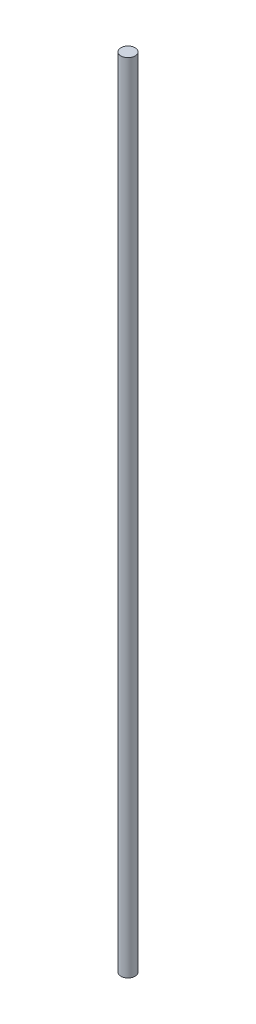
ISO-10303-21;
HEADER;
FILE_DESCRIPTION(('STEP AP214'),'2;1');
FILE_NAME('part.step','',(''),(''),'','','');
FILE_SCHEMA(('AUTOMOTIVE_DESIGN { 1 0 10303 214 1 1 1 1 }'));
ENDSEC;
DATA;
#1=APPLICATION_CONTEXT('core data for automotive mechanical design processes');
#2=APPLICATION_PROTOCOL_DEFINITION('international standard','automotive_design',2000,#1);
#3=PRODUCT_CONTEXT('',#1,'mechanical');
#4=PRODUCT('Part','Part','',(#3));
#5=PRODUCT_RELATED_PRODUCT_CATEGORY('part','',(#4));
#6=PRODUCT_DEFINITION_FORMATION('','',#4);
#7=PRODUCT_DEFINITION_CONTEXT('part definition',#1,'design');
#8=PRODUCT_DEFINITION('design','',#6,#7);
#9=PRODUCT_DEFINITION_SHAPE('','',#8);
#10=(LENGTH_UNIT() NAMED_UNIT(*) SI_UNIT(.MILLI.,.METRE.));
#11=(NAMED_UNIT(*) PLANE_ANGLE_UNIT() SI_UNIT($,.RADIAN.));
#12=(NAMED_UNIT(*) SI_UNIT($,.STERADIAN.) SOLID_ANGLE_UNIT());
#13=UNCERTAINTY_MEASURE_WITH_UNIT(LENGTH_MEASURE(1.E-05),#10,'distance_accuracy_value','');
#14=(GEOMETRIC_REPRESENTATION_CONTEXT(3) GLOBAL_UNCERTAINTY_ASSIGNED_CONTEXT((#13)) GLOBAL_UNIT_ASSIGNED_CONTEXT((#10,
#11,#12)) REPRESENTATION_CONTEXT('',''));
#15=CARTESIAN_POINT('',(0.,0.,0.));
#16=DIRECTION('',(0.,0.,1.));
#17=DIRECTION('',(1.,0.,0.));
#18=AXIS2_PLACEMENT_3D('',#15,#16,#17);
#19=CARTESIAN_POINT('',(0.,446.,0.));
#20=DIRECTION('',(0.,-1.,0.));
#21=DIRECTION('',(0.,0.,-1.));
#22=AXIS2_PLACEMENT_3D('',#19,#20,#21);
#23=CYLINDRICAL_SURFACE('',#22,4.);
#24=CARTESIAN_POINT('',(0.,446.,0.));
#25=DIRECTION('',(0.,1.,0.));
#26=DIRECTION('',(0.,0.,1.));
#27=AXIS2_PLACEMENT_3D('',#24,#25,#26);
#28=CIRCLE('',#27,4.);
#29=CARTESIAN_POINT('',(0.,446.,4.));
#30=VERTEX_POINT('',#29);
#31=EDGE_CURVE('E10',#30,#30,#28,.T.);
#32=ORIENTED_EDGE('',*,*,#31,.F.);
#33=EDGE_LOOP('',(#32));
#34=FACE_BOUND('',#33,.T.);
#35=CARTESIAN_POINT('',(0.,0.,0.));
#36=DIRECTION('',(0.,1.,0.));
#37=DIRECTION('',(0.,0.,1.));
#38=AXIS2_PLACEMENT_3D('',#35,#36,#37);
#39=CIRCLE('',#38,4.);
#40=CARTESIAN_POINT('',(0.,0.,4.));
#41=VERTEX_POINT('',#40);
#42=EDGE_CURVE('E34',#41,#41,#39,.T.);
#43=ORIENTED_EDGE('',*,*,#42,.T.);
#44=EDGE_LOOP('',(#43));
#45=FACE_BOUND('',#44,.T.);
#46=ADVANCED_FACE('F31',(#34,#45),#23,.T.);
#47=CARTESIAN_POINT('',(0.,446.,0.));
#48=DIRECTION('',(0.,1.,0.));
#49=DIRECTION('',(0.,0.,1.));
#50=AXIS2_PLACEMENT_3D('',#47,#48,#49);
#51=PLANE('',#50);
#52=ORIENTED_EDGE('',*,*,#31,.T.);
#53=EDGE_LOOP('',(#52));
#54=FACE_BOUND('',#53,.T.);
#55=ADVANCED_FACE('F46',(#54),#51,.T.);
#56=CARTESIAN_POINT('',(0.,0.,0.));
#57=DIRECTION('',(0.,1.,0.));
#58=DIRECTION('',(0.,0.,1.));
#59=AXIS2_PLACEMENT_3D('',#56,#57,#58);
#60=PLANE('',#59);
#61=ORIENTED_EDGE('',*,*,#42,.F.);
#62=EDGE_LOOP('',(#61));
#63=FACE_BOUND('',#62,.T.);
#64=ADVANCED_FACE('F44',(#63),#60,.F.);
#65=CLOSED_SHELL('',(#46,#55,#64));
#66=MANIFOLD_SOLID_BREP('B2',#65);
#67=ADVANCED_BREP_SHAPE_REPRESENTATION('',(#18,#66),#14);
#68=SHAPE_DEFINITION_REPRESENTATION(#9,#67);
ENDSEC;
END-ISO-10303-21;
